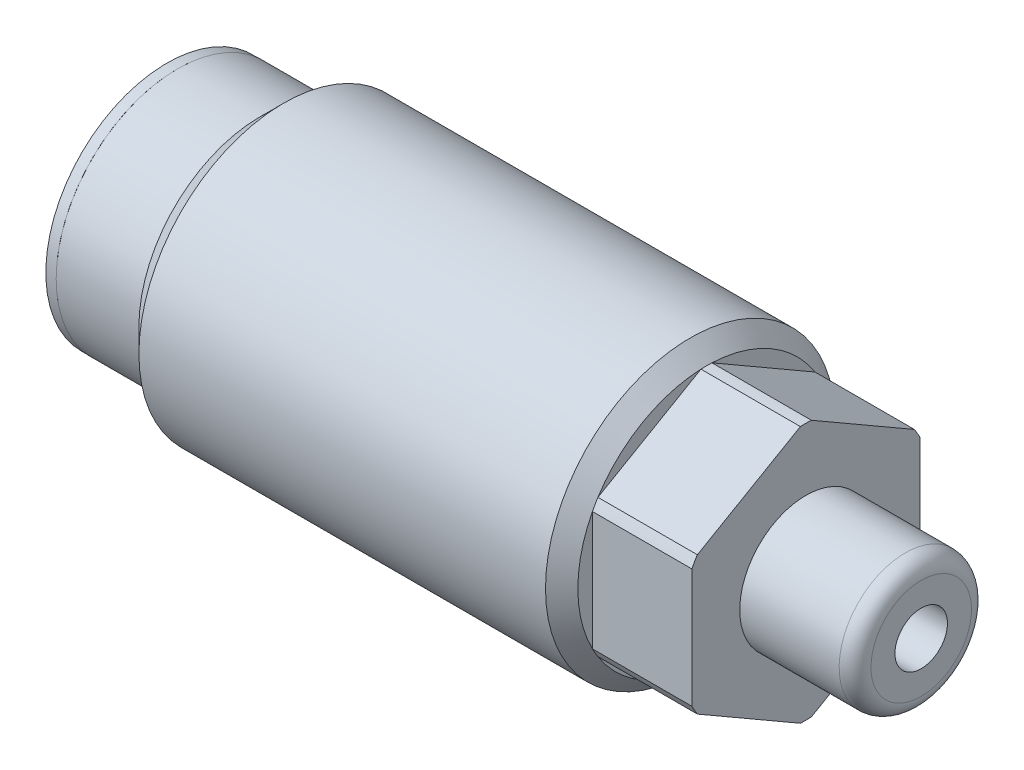
ISO-10303-21;
HEADER;
FILE_DESCRIPTION(('STEP AP214'),'2;1');
FILE_NAME('part.step','',(''),(''),'','','');
FILE_SCHEMA(('AUTOMOTIVE_DESIGN { 1 0 10303 214 1 1 1 1 }'));
ENDSEC;
DATA;
#1=APPLICATION_CONTEXT('core data for automotive mechanical design processes');
#2=APPLICATION_PROTOCOL_DEFINITION('international standard','automotive_design',2000,#1);
#3=PRODUCT_CONTEXT('',#1,'mechanical');
#4=PRODUCT('Part','Part','',(#3));
#5=PRODUCT_RELATED_PRODUCT_CATEGORY('part','',(#4));
#6=PRODUCT_DEFINITION_FORMATION('','',#4);
#7=PRODUCT_DEFINITION_CONTEXT('part definition',#1,'design');
#8=PRODUCT_DEFINITION('design','',#6,#7);
#9=PRODUCT_DEFINITION_SHAPE('','',#8);
#10=(LENGTH_UNIT() NAMED_UNIT(*) SI_UNIT(.MILLI.,.METRE.));
#11=(NAMED_UNIT(*) PLANE_ANGLE_UNIT() SI_UNIT($,.RADIAN.));
#12=(NAMED_UNIT(*) SI_UNIT($,.STERADIAN.) SOLID_ANGLE_UNIT());
#13=UNCERTAINTY_MEASURE_WITH_UNIT(LENGTH_MEASURE(1.E-05),#10,'distance_accuracy_value','');
#14=(GEOMETRIC_REPRESENTATION_CONTEXT(3) GLOBAL_UNCERTAINTY_ASSIGNED_CONTEXT((#13)) GLOBAL_UNIT_ASSIGNED_CONTEXT((#10,
#11,#12)) REPRESENTATION_CONTEXT('',''));
#15=CARTESIAN_POINT('',(0.,0.,0.));
#16=DIRECTION('',(0.,0.,1.));
#17=DIRECTION('',(1.,0.,0.));
#18=AXIS2_PLACEMENT_3D('',#15,#16,#17);
#19=CARTESIAN_POINT('',(71.247,0.,0.));
#20=DIRECTION('',(-1.,0.,0.));
#21=DIRECTION('',(0.,-1.,0.));
#22=AXIS2_PLACEMENT_3D('',#19,#20,#21);
#23=PLANE('',#22);
#24=CARTESIAN_POINT('',(71.247,0.,0.));
#25=DIRECTION('',(-1.,0.,0.));
#26=DIRECTION('',(0.,-1.,0.));
#27=AXIS2_PLACEMENT_3D('',#24,#25,#26);
#28=CIRCLE('',#27,4.8133);
#29=CARTESIAN_POINT('',(71.247,-4.8133,0.));
#30=VERTEX_POINT('',#29);
#31=EDGE_CURVE('E12',#30,#30,#28,.F.);
#32=ORIENTED_EDGE('',*,*,#31,.T.);
#33=EDGE_LOOP('',(#32));
#34=FACE_BOUND('',#33,.T.);
#35=CARTESIAN_POINT('',(71.247,0.,0.));
#36=DIRECTION('',(-1.,0.,0.));
#37=DIRECTION('',(0.,0.,1.));
#38=AXIS2_PLACEMENT_3D('',#35,#36,#37);
#39=CIRCLE('',#38,2.5146);
#40=CARTESIAN_POINT('',(71.247,0.,2.5146));
#41=VERTEX_POINT('',#40);
#42=EDGE_CURVE('E141',#41,#41,#39,.T.);
#43=ORIENTED_EDGE('',*,*,#42,.T.);
#44=EDGE_LOOP('',(#43));
#45=FACE_BOUND('',#44,.T.);
#46=ADVANCED_FACE('F41',(#34,#45),#23,.F.);
#47=CARTESIAN_POINT('',(50.673,13.8684,0.));
#48=DIRECTION('',(1.,0.,0.));
#49=DIRECTION('',(0.,0.,-1.));
#50=AXIS2_PLACEMENT_3D('',#47,#48,#49);
#51=PLANE('',#50);
#52=DIRECTION('',(0.,-0.5,-0.866025403784439));
#53=VECTOR('',#52,1.);
#54=CARTESIAN_POINT('',(50.673,-6.30581964008909,10.922));
#55=LINE('',#54,#53);
#56=CARTESIAN_POINT('',(50.673,-6.60970870731347,10.3956486957027));
#57=VERTEX_POINT('',#56);
#58=CARTESIAN_POINT('',(50.673,-12.3077502129538,0.526351304297332));
#59=VERTEX_POINT('',#58);
#60=EDGE_CURVE('E221',#57,#59,#55,.T.);
#61=ORIENTED_EDGE('',*,*,#60,.F.);
#62=CARTESIAN_POINT('',(50.673,0.,0.));
#63=DIRECTION('',(1.,0.,0.));
#64=DIRECTION('',(0.,0.,-1.));
#65=AXIS2_PLACEMENT_3D('',#62,#63,#64);
#66=CIRCLE('',#65,12.319);
#67=EDGE_CURVE('E250',#57,#59,#66,.T.);
#68=ORIENTED_EDGE('',*,*,#67,.T.);
#69=EDGE_LOOP('',(#61,#68));
#70=FACE_BOUND('',#69,.T.);
#71=ADVANCED_FACE('F269',(#70),#51,.T.);
#72=DIRECTION('',(0.,0.5,-0.866025403784439));
#73=VECTOR('',#72,1.);
#74=CARTESIAN_POINT('',(50.673,-12.6116392801782,0.));
#75=LINE('',#74,#73);
#76=CARTESIAN_POINT('',(50.673,-12.3077502129538,-0.526351304297346));
#77=VERTEX_POINT('',#76);
#78=CARTESIAN_POINT('',(50.673,-6.60970870731348,-10.3956486957027));
#79=VERTEX_POINT('',#78);
#80=EDGE_CURVE('E194',#77,#79,#75,.T.);
#81=ORIENTED_EDGE('',*,*,#80,.F.);
#82=CARTESIAN_POINT('',(50.673,0.,0.));
#83=DIRECTION('',(1.,0.,0.));
#84=DIRECTION('',(0.,0.,-1.));
#85=AXIS2_PLACEMENT_3D('',#82,#83,#84);
#86=CIRCLE('',#85,12.319);
#87=EDGE_CURVE('E55',#77,#79,#86,.T.);
#88=ORIENTED_EDGE('',*,*,#87,.T.);
#89=EDGE_LOOP('',(#81,#88));
#90=FACE_BOUND('',#89,.T.);
#91=ADVANCED_FACE('F275',(#90),#51,.T.);
#92=DIRECTION('',(0.,1.,0.));
#93=VECTOR('',#92,1.);
#94=CARTESIAN_POINT('',(50.673,-6.3058196400891,-10.922));
#95=LINE('',#94,#93);
#96=CARTESIAN_POINT('',(50.673,-5.69804150564033,-10.922));
#97=VERTEX_POINT('',#96);
#98=CARTESIAN_POINT('',(50.673,5.69804150564033,-10.922));
#99=VERTEX_POINT('',#98);
#100=EDGE_CURVE('E189',#97,#99,#95,.T.);
#101=ORIENTED_EDGE('',*,*,#100,.F.);
#102=CARTESIAN_POINT('',(50.673,0.,0.));
#103=DIRECTION('',(1.,0.,0.));
#104=DIRECTION('',(0.,0.,-1.));
#105=AXIS2_PLACEMENT_3D('',#102,#103,#104);
#106=CIRCLE('',#105,12.319);
#107=EDGE_CURVE('E247',#97,#99,#106,.T.);
#108=ORIENTED_EDGE('',*,*,#107,.T.);
#109=EDGE_LOOP('',(#101,#108));
#110=FACE_BOUND('',#109,.T.);
#111=ADVANCED_FACE('F460',(#110),#51,.T.);
#112=DIRECTION('',(0.,0.5,0.866025403784438));
#113=VECTOR('',#112,1.);
#114=CARTESIAN_POINT('',(50.673,6.30581964008909,-10.922));
#115=LINE('',#114,#113);
#116=CARTESIAN_POINT('',(50.673,6.60970870731347,-10.3956486957027));
#117=VERTEX_POINT('',#116);
#118=CARTESIAN_POINT('',(50.673,12.3077502129538,-0.526351304297339));
#119=VERTEX_POINT('',#118);
#120=EDGE_CURVE('E212',#117,#119,#115,.T.);
#121=ORIENTED_EDGE('',*,*,#120,.F.);
#122=CARTESIAN_POINT('',(50.673,0.,0.));
#123=DIRECTION('',(1.,0.,0.));
#124=DIRECTION('',(0.,0.,-1.));
#125=AXIS2_PLACEMENT_3D('',#122,#123,#124);
#126=CIRCLE('',#125,12.319);
#127=EDGE_CURVE('E245',#117,#119,#126,.T.);
#128=ORIENTED_EDGE('',*,*,#127,.T.);
#129=EDGE_LOOP('',(#121,#128));
#130=FACE_BOUND('',#129,.T.);
#131=ADVANCED_FACE('F469',(#130),#51,.T.);
#132=DIRECTION('',(0.,-0.5,0.866025403784439));
#133=VECTOR('',#132,1.);
#134=CARTESIAN_POINT('',(50.673,12.6116392801782,0.));
#135=LINE('',#134,#133);
#136=CARTESIAN_POINT('',(50.673,12.3077502129538,0.526351304297333));
#137=VERTEX_POINT('',#136);
#138=CARTESIAN_POINT('',(50.673,6.60970870731348,10.3956486957027));
#139=VERTEX_POINT('',#138);
#140=EDGE_CURVE('E215',#137,#139,#135,.T.);
#141=ORIENTED_EDGE('',*,*,#140,.F.);
#142=CARTESIAN_POINT('',(50.673,0.,0.));
#143=DIRECTION('',(1.,0.,0.));
#144=DIRECTION('',(0.,0.,-1.));
#145=AXIS2_PLACEMENT_3D('',#142,#143,#144);
#146=CIRCLE('',#145,12.319);
#147=EDGE_CURVE('E243',#137,#139,#146,.T.);
#148=ORIENTED_EDGE('',*,*,#147,.T.);
#149=EDGE_LOOP('',(#141,#148));
#150=FACE_BOUND('',#149,.T.);
#151=ADVANCED_FACE('F291',(#150),#51,.T.);
#152=CARTESIAN_POINT('',(60.198,18.9174589202673,-10.922));
#153=DIRECTION('',(1.,0.,0.));
#154=DIRECTION('',(0.,0.,-1.));
#155=AXIS2_PLACEMENT_3D('',#152,#153,#154);
#156=PLANE('',#155);
#157=CARTESIAN_POINT('',(60.198,0.,0.));
#158=DIRECTION('',(-1.,0.,0.));
#159=DIRECTION('',(0.,-1.,0.));
#160=AXIS2_PLACEMENT_3D('',#157,#158,#159);
#161=CIRCLE('',#160,6.3373);
#162=CARTESIAN_POINT('',(60.198,-6.3373,0.));
#163=VERTEX_POINT('',#162);
#164=EDGE_CURVE('E186',#163,#163,#161,.T.);
#165=ORIENTED_EDGE('',*,*,#164,.T.);
#166=EDGE_LOOP('',(#165));
#167=FACE_BOUND('',#166,.T.);
#168=DIRECTION('',(0.,1.,0.));
#169=VECTOR('',#168,1.);
#170=CARTESIAN_POINT('',(60.198,-6.3058196400891,-10.922));
#171=LINE('',#170,#169);
#172=CARTESIAN_POINT('',(60.198,-5.69804150564034,-10.922));
#173=VERTEX_POINT('',#172);
#174=CARTESIAN_POINT('',(60.198,5.69804150564034,-10.922));
#175=VERTEX_POINT('',#174);
#176=EDGE_CURVE('E190',#173,#175,#171,.T.);
#177=ORIENTED_EDGE('',*,*,#176,.T.);
#178=CARTESIAN_POINT('',(60.198,0.,0.));
#179=DIRECTION('',(1.,0.,0.));
#180=DIRECTION('',(0.,0.,-1.));
#181=AXIS2_PLACEMENT_3D('',#178,#179,#180);
#182=CIRCLE('',#181,12.319);
#183=CARTESIAN_POINT('',(60.198,6.60970870731347,-10.3956486957027));
#184=VERTEX_POINT('',#183);
#185=EDGE_CURVE('E147',#175,#184,#182,.T.);
#186=ORIENTED_EDGE('',*,*,#185,.T.);
#187=DIRECTION('',(0.,0.5,0.866025403784438));
#188=VECTOR('',#187,1.);
#189=CARTESIAN_POINT('',(60.198,6.30581964008909,-10.922));
#190=LINE('',#189,#188);
#191=CARTESIAN_POINT('',(60.198,12.3077502129538,-0.526351304297342));
#192=VERTEX_POINT('',#191);
#193=EDGE_CURVE('E193',#184,#192,#190,.T.);
#194=ORIENTED_EDGE('',*,*,#193,.T.);
#195=CARTESIAN_POINT('',(60.198,12.3077502129538,0.526351304297333));
#196=VERTEX_POINT('',#195);
#197=EDGE_CURVE('E151',#192,#196,#182,.T.);
#198=ORIENTED_EDGE('',*,*,#197,.T.);
#199=DIRECTION('',(0.,-0.5,0.866025403784439));
#200=VECTOR('',#199,1.);
#201=CARTESIAN_POINT('',(60.198,12.6116392801782,0.));
#202=LINE('',#201,#200);
#203=CARTESIAN_POINT('',(60.198,6.60970870731348,10.3956486957027));
#204=VERTEX_POINT('',#203);
#205=EDGE_CURVE('E197',#196,#204,#202,.T.);
#206=ORIENTED_EDGE('',*,*,#205,.T.);
#207=CARTESIAN_POINT('',(60.198,5.69804150564035,10.922));
#208=VERTEX_POINT('',#207);
#209=EDGE_CURVE('E599',#204,#208,#182,.T.);
#210=ORIENTED_EDGE('',*,*,#209,.T.);
#211=DIRECTION('',(0.,-1.,0.));
#212=VECTOR('',#211,1.);
#213=CARTESIAN_POINT('',(60.198,6.3058196400891,10.922));
#214=LINE('',#213,#212);
#215=CARTESIAN_POINT('',(60.198,-5.69804150564035,10.922));
#216=VERTEX_POINT('',#215);
#217=EDGE_CURVE('E200',#208,#216,#214,.T.);
#218=ORIENTED_EDGE('',*,*,#217,.T.);
#219=CARTESIAN_POINT('',(60.198,-6.60970870731346,10.3956486957027));
#220=VERTEX_POINT('',#219);
#221=EDGE_CURVE('E597',#216,#220,#182,.T.);
#222=ORIENTED_EDGE('',*,*,#221,.T.);
#223=DIRECTION('',(0.,-0.5,-0.866025403784439));
#224=VECTOR('',#223,1.);
#225=CARTESIAN_POINT('',(60.198,-6.30581964008909,10.922));
#226=LINE('',#225,#224);
#227=CARTESIAN_POINT('',(60.198,-12.3077502129538,0.526351304297332));
#228=VERTEX_POINT('',#227);
#229=EDGE_CURVE('E203',#220,#228,#226,.T.);
#230=ORIENTED_EDGE('',*,*,#229,.T.);
#231=CARTESIAN_POINT('',(60.198,-12.3077502129538,-0.526351304297335));
#232=VERTEX_POINT('',#231);
#233=EDGE_CURVE('E596',#228,#232,#182,.T.);
#234=ORIENTED_EDGE('',*,*,#233,.T.);
#235=DIRECTION('',(0.,0.5,-0.866025403784439));
#236=VECTOR('',#235,1.);
#237=CARTESIAN_POINT('',(60.198,-12.6116392801782,0.));
#238=LINE('',#237,#236);
#239=CARTESIAN_POINT('',(60.198,-6.60970870731347,-10.3956486957027));
#240=VERTEX_POINT('',#239);
#241=EDGE_CURVE('E206',#232,#240,#238,.T.);
#242=ORIENTED_EDGE('',*,*,#241,.T.);
#243=EDGE_CURVE('E144',#240,#173,#182,.T.);
#244=ORIENTED_EDGE('',*,*,#243,.T.);
#245=EDGE_LOOP('',(#177,#186,#194,#198,#206,#210,#218,#222,#230,#234,#242,#244));
#246=FACE_BOUND('',#245,.T.);
#247=ADVANCED_FACE('F287',(#167,#246),#156,.T.);
#248=CARTESIAN_POINT('',(60.198,-6.3058196400891,-10.922));
#249=DIRECTION('',(0.,0.,1.));
#250=DIRECTION('',(1.,0.,0.));
#251=AXIS2_PLACEMENT_3D('',#248,#249,#250);
#252=PLANE('',#251);
#253=DIRECTION('',(1.,0.,0.));
#254=VECTOR('',#253,1.);
#255=CARTESIAN_POINT('',(11.4472412631699,-5.69804150564034,-10.922));
#256=LINE('',#255,#254);
#257=EDGE_CURVE('E63',#97,#173,#256,.T.);
#258=ORIENTED_EDGE('',*,*,#257,.F.);
#259=ORIENTED_EDGE('',*,*,#100,.T.);
#260=DIRECTION('',(1.,0.,0.));
#261=VECTOR('',#260,1.);
#262=CARTESIAN_POINT('',(11.4472412631699,5.69804150564034,-10.922));
#263=LINE('',#262,#261);
#264=EDGE_CURVE('E176',#175,#99,#263,.F.);
#265=ORIENTED_EDGE('',*,*,#264,.F.);
#266=ORIENTED_EDGE('',*,*,#176,.F.);
#267=EDGE_LOOP('',(#258,#259,#265,#266));
#268=FACE_BOUND('',#267,.T.);
#269=ADVANCED_FACE('F290',(#268),#252,.F.);
#270=CARTESIAN_POINT('',(60.198,6.30581964008909,-10.922));
#271=DIRECTION('',(0.,-0.866025403784439,0.5));
#272=DIRECTION('',(0.,-0.5,-0.866025403784439));
#273=AXIS2_PLACEMENT_3D('',#270,#271,#272);
#274=PLANE('',#273);
#275=DIRECTION('',(1.,0.,0.));
#276=VECTOR('',#275,1.);
#277=CARTESIAN_POINT('',(11.4472412631699,6.60970870731347,-10.3956486957027));
#278=LINE('',#277,#276);
#279=EDGE_CURVE('E174',#117,#184,#278,.T.);
#280=ORIENTED_EDGE('',*,*,#279,.F.);
#281=ORIENTED_EDGE('',*,*,#120,.T.);
#282=DIRECTION('',(1.,0.,0.));
#283=VECTOR('',#282,1.);
#284=CARTESIAN_POINT('',(11.4472412631699,12.3077502129538,-0.526351304297342));
#285=LINE('',#284,#283);
#286=EDGE_CURVE('E171',#192,#119,#285,.F.);
#287=ORIENTED_EDGE('',*,*,#286,.F.);
#288=ORIENTED_EDGE('',*,*,#193,.F.);
#289=EDGE_LOOP('',(#280,#281,#287,#288));
#290=FACE_BOUND('',#289,.T.);
#291=ADVANCED_FACE('F308',(#290),#274,.F.);
#292=CARTESIAN_POINT('',(60.198,12.6116392801782,0.));
#293=DIRECTION('',(0.,-0.866025403784439,-0.5));
#294=DIRECTION('',(0.,0.5,-0.866025403784439));
#295=AXIS2_PLACEMENT_3D('',#292,#293,#294);
#296=PLANE('',#295);
#297=DIRECTION('',(1.,0.,0.));
#298=VECTOR('',#297,1.);
#299=CARTESIAN_POINT('',(11.4472412631699,12.3077502129538,0.526351304297333));
#300=LINE('',#299,#298);
#301=EDGE_CURVE('E169',#137,#196,#300,.T.);
#302=ORIENTED_EDGE('',*,*,#301,.F.);
#303=ORIENTED_EDGE('',*,*,#140,.T.);
#304=DIRECTION('',(1.,0.,0.));
#305=VECTOR('',#304,1.);
#306=CARTESIAN_POINT('',(11.4472412631699,6.60970870731348,10.3956486957027));
#307=LINE('',#306,#305);
#308=EDGE_CURVE('E166',#204,#139,#307,.F.);
#309=ORIENTED_EDGE('',*,*,#308,.F.);
#310=ORIENTED_EDGE('',*,*,#205,.F.);
#311=EDGE_LOOP('',(#302,#303,#309,#310));
#312=FACE_BOUND('',#311,.T.);
#313=ADVANCED_FACE('F304',(#312),#296,.F.);
#314=CARTESIAN_POINT('',(60.198,6.3058196400891,10.922));
#315=DIRECTION('',(0.,0.,-1.));
#316=DIRECTION('',(0.,1.,0.));
#317=AXIS2_PLACEMENT_3D('',#314,#315,#316);
#318=PLANE('',#317);
#319=DIRECTION('',(1.,0.,0.));
#320=VECTOR('',#319,1.);
#321=CARTESIAN_POINT('',(11.4472412631699,5.69804150564035,10.922));
#322=LINE('',#321,#320);
#323=CARTESIAN_POINT('',(50.673,5.69804150564034,10.922));
#324=VERTEX_POINT('',#323);
#325=EDGE_CURVE('E164',#324,#208,#322,.T.);
#326=ORIENTED_EDGE('',*,*,#325,.F.);
#327=DIRECTION('',(0.,-1.,0.));
#328=VECTOR('',#327,1.);
#329=CARTESIAN_POINT('',(50.673,6.3058196400891,10.922));
#330=LINE('',#329,#328);
#331=CARTESIAN_POINT('',(50.673,-5.69804150564035,10.922));
#332=VERTEX_POINT('',#331);
#333=EDGE_CURVE('E218',#324,#332,#330,.T.);
#334=ORIENTED_EDGE('',*,*,#333,.T.);
#335=DIRECTION('',(1.,0.,0.));
#336=VECTOR('',#335,1.);
#337=CARTESIAN_POINT('',(11.4472412631699,-5.69804150564035,10.922));
#338=LINE('',#337,#336);
#339=EDGE_CURVE('E161',#216,#332,#338,.F.);
#340=ORIENTED_EDGE('',*,*,#339,.F.);
#341=ORIENTED_EDGE('',*,*,#217,.F.);
#342=EDGE_LOOP('',(#326,#334,#340,#341));
#343=FACE_BOUND('',#342,.T.);
#344=ADVANCED_FACE('F300',(#343),#318,.F.);
#345=CARTESIAN_POINT('',(60.198,-6.30581964008909,10.922));
#346=DIRECTION('',(0.,0.866025403784439,-0.5));
#347=DIRECTION('',(0.,0.5,0.866025403784439));
#348=AXIS2_PLACEMENT_3D('',#345,#346,#347);
#349=PLANE('',#348);
#350=DIRECTION('',(1.,0.,0.));
#351=VECTOR('',#350,1.);
#352=CARTESIAN_POINT('',(11.4472412631699,-6.60970870731347,10.3956486957027));
#353=LINE('',#352,#351);
#354=EDGE_CURVE('E159',#57,#220,#353,.T.);
#355=ORIENTED_EDGE('',*,*,#354,.F.);
#356=ORIENTED_EDGE('',*,*,#60,.T.);
#357=DIRECTION('',(1.,0.,0.));
#358=VECTOR('',#357,1.);
#359=CARTESIAN_POINT('',(11.4472412631699,-12.3077502129538,0.526351304297332));
#360=LINE('',#359,#358);
#361=EDGE_CURVE('E155',#228,#59,#360,.F.);
#362=ORIENTED_EDGE('',*,*,#361,.F.);
#363=ORIENTED_EDGE('',*,*,#229,.F.);
#364=EDGE_LOOP('',(#355,#356,#362,#363));
#365=FACE_BOUND('',#364,.T.);
#366=ADVANCED_FACE('F296',(#365),#349,.F.);
#367=CARTESIAN_POINT('',(60.198,-12.6116392801782,0.));
#368=DIRECTION('',(0.,0.866025403784439,0.5));
#369=DIRECTION('',(0.,-0.5,0.866025403784439));
#370=AXIS2_PLACEMENT_3D('',#367,#368,#369);
#371=PLANE('',#370);
#372=DIRECTION('',(1.,0.,0.));
#373=VECTOR('',#372,1.);
#374=CARTESIAN_POINT('',(11.4472412631699,-12.3077502129538,-0.526351304297335));
#375=LINE('',#374,#373);
#376=EDGE_CURVE('E236',#77,#232,#375,.T.);
#377=ORIENTED_EDGE('',*,*,#376,.F.);
#378=ORIENTED_EDGE('',*,*,#80,.T.);
#379=DIRECTION('',(1.,0.,0.));
#380=VECTOR('',#379,1.);
#381=CARTESIAN_POINT('',(11.4472412631699,-6.60970870731347,-10.3956486957027));
#382=LINE('',#381,#380);
#383=EDGE_CURVE('E234',#240,#79,#382,.F.);
#384=ORIENTED_EDGE('',*,*,#383,.F.);
#385=ORIENTED_EDGE('',*,*,#241,.F.);
#386=EDGE_LOOP('',(#377,#378,#384,#385));
#387=FACE_BOUND('',#386,.T.);
#388=ADVANCED_FACE('F293',(#387),#371,.F.);
#389=ORIENTED_EDGE('',*,*,#333,.F.);
#390=CARTESIAN_POINT('',(50.673,0.,0.));
#391=DIRECTION('',(1.,0.,0.));
#392=DIRECTION('',(0.,0.,-1.));
#393=AXIS2_PLACEMENT_3D('',#390,#391,#392);
#394=CIRCLE('',#393,12.319);
#395=EDGE_CURVE('E241',#324,#332,#394,.T.);
#396=ORIENTED_EDGE('',*,*,#395,.T.);
#397=EDGE_LOOP('',(#389,#396));
#398=FACE_BOUND('',#397,.T.);
#399=ADVANCED_FACE('F278',(#398),#51,.T.);
#400=CARTESIAN_POINT('',(30.6025425410263,0.,0.));
#401=DIRECTION('',(-1.,0.,0.));
#402=DIRECTION('',(0.,0.,1.));
#403=AXIS2_PLACEMENT_3D('',#400,#401,#402);
#404=CYLINDRICAL_SURFACE('',#403,13.8684);
#405=CARTESIAN_POINT('',(49.1236,0.,0.));
#406=DIRECTION('',(1.,0.,0.));
#407=DIRECTION('',(0.,0.,-1.));
#408=AXIS2_PLACEMENT_3D('',#405,#406,#407);
#409=CIRCLE('',#408,13.8684);
#410=CARTESIAN_POINT('',(49.1236,0.,-13.8684));
#411=VERTEX_POINT('',#410);
#412=EDGE_CURVE('E238',#411,#411,#409,.F.);
#413=ORIENTED_EDGE('',*,*,#412,.T.);
#414=EDGE_LOOP('',(#413));
#415=FACE_BOUND('',#414,.T.);
#416=CARTESIAN_POINT('',(10.1727,0.,0.));
#417=DIRECTION('',(-1.,0.,0.));
#418=DIRECTION('',(0.,0.,1.));
#419=AXIS2_PLACEMENT_3D('',#416,#417,#418);
#420=CIRCLE('',#419,13.8684);
#421=CARTESIAN_POINT('',(10.1727,0.,13.8684));
#422=VERTEX_POINT('',#421);
#423=EDGE_CURVE('E209',#422,#422,#420,.T.);
#424=ORIENTED_EDGE('',*,*,#423,.F.);
#425=EDGE_LOOP('',(#424));
#426=FACE_BOUND('',#425,.T.);
#427=ADVANCED_FACE('F325',(#415,#426),#404,.T.);
#428=CARTESIAN_POINT('',(0.,0.,0.));
#429=DIRECTION('',(-1.,0.,0.));
#430=DIRECTION('',(0.,0.,1.));
#431=AXIS2_PLACEMENT_3D('',#428,#429,#430);
#432=PLANE('',#431);
#433=CARTESIAN_POINT('',(0.,0.,0.));
#434=DIRECTION('',(-1.,0.,0.));
#435=DIRECTION('',(0.,0.,1.));
#436=AXIS2_PLACEMENT_3D('',#433,#434,#435);
#437=CIRCLE('',#436,6.73100000000001);
#438=CARTESIAN_POINT('',(0.,0.,6.73100000000001));
#439=VERTEX_POINT('',#438);
#440=EDGE_CURVE('E180',#439,#439,#437,.T.);
#441=ORIENTED_EDGE('',*,*,#440,.F.);
#442=EDGE_LOOP('',(#441));
#443=FACE_BOUND('',#442,.T.);
#444=CARTESIAN_POINT('',(0.,0.,0.));
#445=DIRECTION('',(-1.,0.,0.));
#446=DIRECTION('',(0.,0.,1.));
#447=AXIS2_PLACEMENT_3D('',#444,#445,#446);
#448=CIRCLE('',#447,11.6205);
#449=CARTESIAN_POINT('',(0.,0.,11.6205));
#450=VERTEX_POINT('',#449);
#451=EDGE_CURVE('E231',#450,#450,#448,.T.);
#452=ORIENTED_EDGE('',*,*,#451,.T.);
#453=EDGE_LOOP('',(#452));
#454=FACE_BOUND('',#453,.T.);
#455=ADVANCED_FACE('F322',(#443,#454),#432,.T.);
#456=CARTESIAN_POINT('',(30.6025425410263,0.,0.));
#457=DIRECTION('',(-1.,0.,0.));
#458=DIRECTION('',(0.,0.,1.));
#459=AXIS2_PLACEMENT_3D('',#456,#457,#458);
#460=CYLINDRICAL_SURFACE('',#459,11.6205);
#461=CARTESIAN_POINT('',(7.9248,0.,0.));
#462=DIRECTION('',(-1.,0.,0.));
#463=DIRECTION('',(0.,0.,1.));
#464=AXIS2_PLACEMENT_3D('',#461,#462,#463);
#465=CIRCLE('',#464,11.6205);
#466=CARTESIAN_POINT('',(7.9248,0.,11.6205));
#467=VERTEX_POINT('',#466);
#468=EDGE_CURVE('E228',#467,#467,#465,.T.);
#469=ORIENTED_EDGE('',*,*,#468,.T.);
#470=EDGE_LOOP('',(#469));
#471=FACE_BOUND('',#470,.T.);
#472=ORIENTED_EDGE('',*,*,#451,.F.);
#473=EDGE_LOOP('',(#472));
#474=FACE_BOUND('',#473,.T.);
#475=ADVANCED_FACE('F318',(#471,#474),#460,.T.);
#476=CARTESIAN_POINT('',(7.9248,0.,0.));
#477=DIRECTION('',(1.,0.,0.));
#478=DIRECTION('',(0.,0.,-1.));
#479=AXIS2_PLACEMENT_3D('',#476,#477,#478);
#480=CONICAL_SURFACE('',#479,11.6205,0.785398163397453);
#481=ORIENTED_EDGE('',*,*,#423,.T.);
#482=EDGE_LOOP('',(#481));
#483=FACE_BOUND('',#482,.T.);
#484=ORIENTED_EDGE('',*,*,#468,.F.);
#485=EDGE_LOOP('',(#484));
#486=FACE_BOUND('',#485,.T.);
#487=ADVANCED_FACE('F286',(#483,#486),#480,.T.);
#488=CARTESIAN_POINT('',(60.198,0.,0.));
#489=DIRECTION('',(-1.,0.,0.));
#490=DIRECTION('',(0.,-1.,0.));
#491=AXIS2_PLACEMENT_3D('',#488,#489,#490);
#492=CYLINDRICAL_SURFACE('',#491,6.3373);
#493=CARTESIAN_POINT('',(69.723,0.,0.));
#494=DIRECTION('',(-1.,0.,0.));
#495=DIRECTION('',(0.,-1.,0.));
#496=AXIS2_PLACEMENT_3D('',#493,#494,#495);
#497=CIRCLE('',#496,6.3373);
#498=CARTESIAN_POINT('',(69.723,-6.3373,0.));
#499=VERTEX_POINT('',#498);
#500=EDGE_CURVE('E49',#499,#499,#497,.T.);
#501=ORIENTED_EDGE('',*,*,#500,.T.);
#502=EDGE_LOOP('',(#501));
#503=FACE_BOUND('',#502,.T.);
#504=ORIENTED_EDGE('',*,*,#164,.F.);
#505=EDGE_LOOP('',(#504));
#506=FACE_BOUND('',#505,.T.);
#507=ADVANCED_FACE('F254',(#503,#506),#492,.T.);
#508=CARTESIAN_POINT('',(1.016,0.,0.));
#509=DIRECTION('',(1.,0.,0.));
#510=DIRECTION('',(0.,0.,-1.));
#511=AXIS2_PLACEMENT_3D('',#508,#509,#510);
#512=PLANE('',#511);
#513=CARTESIAN_POINT('',(1.016,0.,0.));
#514=DIRECTION('',(-1.,0.,0.));
#515=DIRECTION('',(0.,0.,1.));
#516=AXIS2_PLACEMENT_3D('',#513,#514,#515);
#517=CIRCLE('',#516,6.73100000000001);
#518=CARTESIAN_POINT('',(1.016,0.,6.73100000000001));
#519=VERTEX_POINT('',#518);
#520=EDGE_CURVE('E183',#519,#519,#517,.T.);
#521=ORIENTED_EDGE('',*,*,#520,.T.);
#522=EDGE_LOOP('',(#521));
#523=FACE_BOUND('',#522,.T.);
#524=ADVANCED_FACE('F282',(#523),#512,.F.);
#525=CARTESIAN_POINT('',(0.,0.,0.));
#526=DIRECTION('',(-1.,0.,0.));
#527=DIRECTION('',(0.,0.,1.));
#528=AXIS2_PLACEMENT_3D('',#525,#526,#527);
#529=CYLINDRICAL_SURFACE('',#528,6.73100000000001);
#530=ORIENTED_EDGE('',*,*,#520,.F.);
#531=EDGE_LOOP('',(#530));
#532=FACE_BOUND('',#531,.T.);
#533=ORIENTED_EDGE('',*,*,#440,.T.);
#534=EDGE_LOOP('',(#533));
#535=FACE_BOUND('',#534,.T.);
#536=ADVANCED_FACE('F369',(#532,#535),#529,.F.);
#537=CARTESIAN_POINT('',(11.4472412631699,0.,0.));
#538=DIRECTION('',(1.,0.,0.));
#539=DIRECTION('',(0.,0.,-1.));
#540=AXIS2_PLACEMENT_3D('',#537,#538,#539);
#541=CYLINDRICAL_SURFACE('',#540,12.319);
#542=ORIENTED_EDGE('',*,*,#257,.T.);
#543=ORIENTED_EDGE('',*,*,#243,.F.);
#544=ORIENTED_EDGE('',*,*,#383,.T.);
#545=CARTESIAN_POINT('',(50.673,0.,0.));
#546=DIRECTION('',(1.,0.,0.));
#547=DIRECTION('',(0.,0.,-1.));
#548=AXIS2_PLACEMENT_3D('',#545,#546,#547);
#549=CIRCLE('',#548,12.319);
#550=EDGE_CURVE('E152',#97,#79,#549,.F.);
#551=ORIENTED_EDGE('',*,*,#550,.F.);
#552=EDGE_LOOP('',(#542,#543,#544,#551));
#553=FACE_BOUND('',#552,.T.);
#554=ADVANCED_FACE('F376',(#553),#541,.T.);
#555=ORIENTED_EDGE('',*,*,#361,.T.);
#556=EDGE_CURVE('E156',#77,#59,#549,.F.);
#557=ORIENTED_EDGE('',*,*,#556,.F.);
#558=ORIENTED_EDGE('',*,*,#376,.T.);
#559=ORIENTED_EDGE('',*,*,#233,.F.);
#560=EDGE_LOOP('',(#555,#557,#558,#559));
#561=FACE_BOUND('',#560,.T.);
#562=ADVANCED_FACE('F383',(#561),#541,.T.);
#563=ORIENTED_EDGE('',*,*,#339,.T.);
#564=EDGE_CURVE('E580',#57,#332,#549,.F.);
#565=ORIENTED_EDGE('',*,*,#564,.F.);
#566=ORIENTED_EDGE('',*,*,#354,.T.);
#567=ORIENTED_EDGE('',*,*,#221,.F.);
#568=EDGE_LOOP('',(#563,#565,#566,#567));
#569=FACE_BOUND('',#568,.T.);
#570=ADVANCED_FACE('F390',(#569),#541,.T.);
#571=ORIENTED_EDGE('',*,*,#308,.T.);
#572=EDGE_CURVE('E577',#324,#139,#549,.F.);
#573=ORIENTED_EDGE('',*,*,#572,.F.);
#574=ORIENTED_EDGE('',*,*,#325,.T.);
#575=ORIENTED_EDGE('',*,*,#209,.F.);
#576=EDGE_LOOP('',(#571,#573,#574,#575));
#577=FACE_BOUND('',#576,.T.);
#578=ADVANCED_FACE('F397',(#577),#541,.T.);
#579=ORIENTED_EDGE('',*,*,#286,.T.);
#580=EDGE_CURVE('E575',#137,#119,#549,.F.);
#581=ORIENTED_EDGE('',*,*,#580,.F.);
#582=ORIENTED_EDGE('',*,*,#301,.T.);
#583=ORIENTED_EDGE('',*,*,#197,.F.);
#584=EDGE_LOOP('',(#579,#581,#582,#583));
#585=FACE_BOUND('',#584,.T.);
#586=ADVANCED_FACE('F404',(#585),#541,.T.);
#587=ORIENTED_EDGE('',*,*,#264,.T.);
#588=EDGE_CURVE('E150',#117,#99,#549,.F.);
#589=ORIENTED_EDGE('',*,*,#588,.F.);
#590=ORIENTED_EDGE('',*,*,#279,.T.);
#591=ORIENTED_EDGE('',*,*,#185,.F.);
#592=EDGE_LOOP('',(#587,#589,#590,#591));
#593=FACE_BOUND('',#592,.T.);
#594=ADVANCED_FACE('F265',(#593),#541,.T.);
#595=CARTESIAN_POINT('',(49.1236,0.,0.));
#596=DIRECTION('',(-1.,0.,0.));
#597=DIRECTION('',(0.,0.,1.));
#598=AXIS2_PLACEMENT_3D('',#595,#596,#597);
#599=CONICAL_SURFACE('',#598,13.8684,0.785398163397452);
#600=ORIENTED_EDGE('',*,*,#67,.F.);
#601=ORIENTED_EDGE('',*,*,#564,.T.);
#602=ORIENTED_EDGE('',*,*,#395,.F.);
#603=ORIENTED_EDGE('',*,*,#572,.T.);
#604=ORIENTED_EDGE('',*,*,#147,.F.);
#605=ORIENTED_EDGE('',*,*,#580,.T.);
#606=ORIENTED_EDGE('',*,*,#127,.F.);
#607=ORIENTED_EDGE('',*,*,#588,.T.);
#608=ORIENTED_EDGE('',*,*,#107,.F.);
#609=ORIENTED_EDGE('',*,*,#550,.T.);
#610=ORIENTED_EDGE('',*,*,#87,.F.);
#611=ORIENTED_EDGE('',*,*,#556,.T.);
#612=EDGE_LOOP('',(#600,#601,#602,#603,#604,#605,#606,#607,#608,#609,#610,#611));
#613=FACE_BOUND('',#612,.T.);
#614=ORIENTED_EDGE('',*,*,#412,.F.);
#615=EDGE_LOOP('',(#614));
#616=FACE_BOUND('',#615,.T.);
#617=ADVANCED_FACE('F258',(#613,#616),#599,.T.);
#618=CARTESIAN_POINT('',(69.723,0.,0.));
#619=DIRECTION('',(-1.,0.,0.));
#620=DIRECTION('',(0.,-1.,0.));
#621=AXIS2_PLACEMENT_3D('',#618,#619,#620);
#622=TOROIDAL_SURFACE('',#621,4.8133,1.524);
#623=ORIENTED_EDGE('',*,*,#31,.F.);
#624=EDGE_LOOP('',(#623));
#625=FACE_BOUND('',#624,.T.);
#626=ORIENTED_EDGE('',*,*,#500,.F.);
#627=EDGE_LOOP('',(#626));
#628=FACE_BOUND('',#627,.T.);
#629=ADVANCED_FACE('F43',(#625,#628),#622,.T.);
#630=CARTESIAN_POINT('',(0.,0.,0.));
#631=DIRECTION('',(-1.,0.,0.));
#632=DIRECTION('',(0.,0.,1.));
#633=AXIS2_PLACEMENT_3D('',#630,#631,#632);
#634=CYLINDRICAL_SURFACE('',#633,2.5146);
#635=CARTESIAN_POINT('',(56.7559241126067,0.,0.));
#636=DIRECTION('',(-1.,0.,0.));
#637=DIRECTION('',(0.,0.,1.));
#638=AXIS2_PLACEMENT_3D('',#635,#636,#637);
#639=CIRCLE('',#638,2.5146);
#640=CARTESIAN_POINT('',(56.7559241126067,0.,2.5146));
#641=VERTEX_POINT('',#640);
#642=EDGE_CURVE('E139',#641,#641,#639,.T.);
#643=ORIENTED_EDGE('',*,*,#642,.T.);
#644=EDGE_LOOP('',(#643));
#645=FACE_BOUND('',#644,.T.);
#646=ORIENTED_EDGE('',*,*,#42,.F.);
#647=EDGE_LOOP('',(#646));
#648=FACE_BOUND('',#647,.T.);
#649=ADVANCED_FACE('F135',(#645,#648),#634,.F.);
#650=CARTESIAN_POINT('',(56.7559241126067,0.,0.));
#651=DIRECTION('',(1.,0.,0.));
#652=DIRECTION('',(0.,0.,-1.));
#653=AXIS2_PLACEMENT_3D('',#650,#651,#652);
#654=CONICAL_SURFACE('',#653,2.5146,1.02974425867665);
#655=CARTESIAN_POINT('',(55.245,0.,0.));
#656=VERTEX_POINT('',#655);
#657=VERTEX_LOOP('',#656);
#658=FACE_BOUND('',#657,.T.);
#659=ORIENTED_EDGE('',*,*,#642,.F.);
#660=EDGE_LOOP('',(#659));
#661=FACE_BOUND('',#660,.T.);
#662=ADVANCED_FACE('F132',(#658,#661),#654,.F.);
#663=CLOSED_SHELL('',(#46,#71,#91,#111,#131,#151,#247,#269,#291,#313,#344,#366,#388,#399,#427,
#455,#475,#487,#507,#524,#536,#554,#562,#570,#578,#586,#594,#617,#629,#649,#662));
#664=MANIFOLD_SOLID_BREP('B2',#663);
#665=CARTESIAN_POINT('',(-0.0254000000000045,9.5885,0.));
#666=DIRECTION('',(1.,0.,0.));
#667=DIRECTION('',(0.,0.,-1.));
#668=AXIS2_PLACEMENT_3D('',#665,#666,#667);
#669=PLANE('',#668);
#670=CARTESIAN_POINT('',(-0.0254000000000048,0.,0.));
#671=DIRECTION('',(1.,0.,0.));
#672=DIRECTION('',(0.,0.,-1.));
#673=AXIS2_PLACEMENT_3D('',#670,#671,#672);
#674=CIRCLE('',#673,11.5951);
#675=CARTESIAN_POINT('',(-0.0254000000000048,0.,-11.5951));
#676=VERTEX_POINT('',#675);
#677=EDGE_CURVE('E40',#676,#676,#674,.T.);
#678=ORIENTED_EDGE('',*,*,#677,.T.);
#679=EDGE_LOOP('',(#678));
#680=FACE_BOUND('',#679,.T.);
#681=CARTESIAN_POINT('',(-0.025400000000004,0.,0.));
#682=DIRECTION('',(1.,0.,0.));
#683=DIRECTION('',(0.,0.,-1.));
#684=AXIS2_PLACEMENT_3D('',#681,#682,#683);
#685=CIRCLE('',#684,9.5885);
#686=CARTESIAN_POINT('',(-0.025400000000004,0.,-9.5885));
#687=VERTEX_POINT('',#686);
#688=EDGE_CURVE('E638',#687,#687,#685,.T.);
#689=ORIENTED_EDGE('',*,*,#688,.F.);
#690=EDGE_LOOP('',(#689));
#691=FACE_BOUND('',#690,.T.);
#692=ADVANCED_FACE('F624',(#680,#691),#669,.T.);
#693=CARTESIAN_POINT('',(-0.762,0.,0.));
#694=DIRECTION('',(1.,0.,0.));
#695=DIRECTION('',(0.,0.,-1.));
#696=AXIS2_PLACEMENT_3D('',#693,#694,#695);
#697=CYLINDRICAL_SURFACE('',#696,11.5951);
#698=CARTESIAN_POINT('',(-1.016,0.,0.));
#699=DIRECTION('',(1.,0.,0.));
#700=DIRECTION('',(0.,0.,-1.));
#701=AXIS2_PLACEMENT_3D('',#698,#699,#700);
#702=CIRCLE('',#701,11.5951);
#703=CARTESIAN_POINT('',(-1.016,0.,-11.5951));
#704=VERTEX_POINT('',#703);
#705=EDGE_CURVE('E630',#704,#704,#702,.T.);
#706=ORIENTED_EDGE('',*,*,#705,.T.);
#707=EDGE_LOOP('',(#706));
#708=FACE_BOUND('',#707,.T.);
#709=ORIENTED_EDGE('',*,*,#677,.F.);
#710=EDGE_LOOP('',(#709));
#711=FACE_BOUND('',#710,.T.);
#712=ADVANCED_FACE('F648',(#708,#711),#697,.T.);
#713=CARTESIAN_POINT('',(-1.016,11.5951,0.));
#714=DIRECTION('',(-1.,0.,0.));
#715=DIRECTION('',(0.,0.,1.));
#716=AXIS2_PLACEMENT_3D('',#713,#714,#715);
#717=PLANE('',#716);
#718=CARTESIAN_POINT('',(-1.016,0.,0.));
#719=DIRECTION('',(1.,0.,0.));
#720=DIRECTION('',(0.,0.,-1.));
#721=AXIS2_PLACEMENT_3D('',#718,#719,#720);
#722=CIRCLE('',#721,9.5885);
#723=CARTESIAN_POINT('',(-1.016,0.,-9.5885));
#724=VERTEX_POINT('',#723);
#725=EDGE_CURVE('E634',#724,#724,#722,.T.);
#726=ORIENTED_EDGE('',*,*,#725,.T.);
#727=EDGE_LOOP('',(#726));
#728=FACE_BOUND('',#727,.T.);
#729=ORIENTED_EDGE('',*,*,#705,.F.);
#730=EDGE_LOOP('',(#729));
#731=FACE_BOUND('',#730,.T.);
#732=ADVANCED_FACE('F652',(#728,#731),#717,.T.);
#733=CARTESIAN_POINT('',(-0.762,0.,0.));
#734=DIRECTION('',(1.,0.,0.));
#735=DIRECTION('',(0.,0.,-1.));
#736=AXIS2_PLACEMENT_3D('',#733,#734,#735);
#737=CYLINDRICAL_SURFACE('',#736,9.5885);
#738=ORIENTED_EDGE('',*,*,#688,.T.);
#739=EDGE_LOOP('',(#738));
#740=FACE_BOUND('',#739,.T.);
#741=ORIENTED_EDGE('',*,*,#725,.F.);
#742=EDGE_LOOP('',(#741));
#743=FACE_BOUND('',#742,.T.);
#744=ADVANCED_FACE('F644',(#740,#743),#737,.F.);
#745=CLOSED_SHELL('',(#692,#712,#732,#744));
#746=MANIFOLD_SOLID_BREP('B6',#745);
#747=ADVANCED_BREP_SHAPE_REPRESENTATION('',(#18,#664,#746),#14);
#748=SHAPE_DEFINITION_REPRESENTATION(#9,#747);
ENDSEC;
END-ISO-10303-21;
